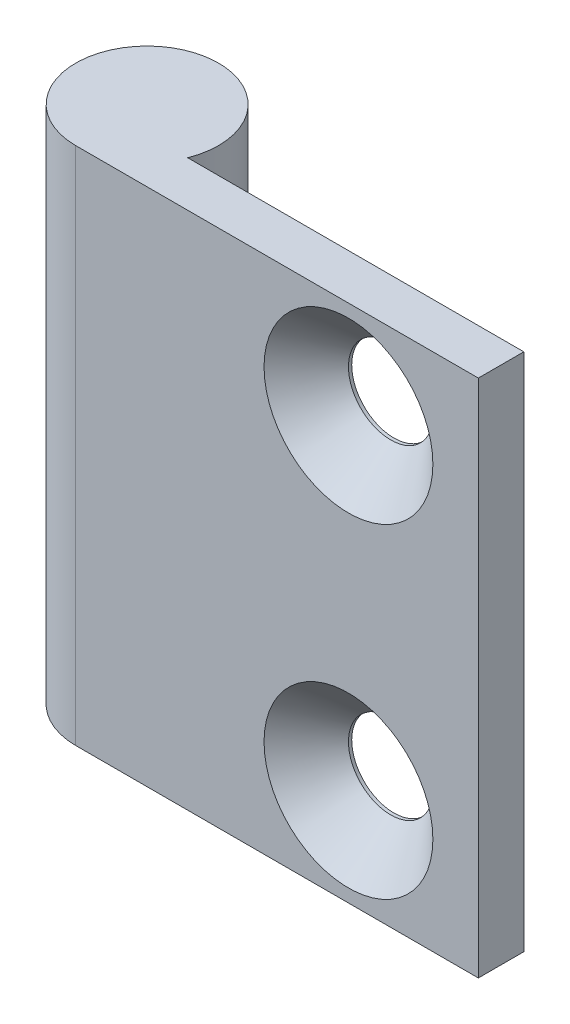
ISO-10303-21;
HEADER;
FILE_DESCRIPTION(('STEP AP214'),'2;1');
FILE_NAME('part.step','',(''),(''),'','','');
FILE_SCHEMA(('AUTOMOTIVE_DESIGN { 1 0 10303 214 1 1 1 1 }'));
ENDSEC;
DATA;
#1=APPLICATION_CONTEXT('core data for automotive mechanical design processes');
#2=APPLICATION_PROTOCOL_DEFINITION('international standard','automotive_design',2000,#1);
#3=PRODUCT_CONTEXT('',#1,'mechanical');
#4=PRODUCT('Part','Part','',(#3));
#5=PRODUCT_RELATED_PRODUCT_CATEGORY('part','',(#4));
#6=PRODUCT_DEFINITION_FORMATION('','',#4);
#7=PRODUCT_DEFINITION_CONTEXT('part definition',#1,'design');
#8=PRODUCT_DEFINITION('design','',#6,#7);
#9=PRODUCT_DEFINITION_SHAPE('','',#8);
#10=(LENGTH_UNIT() NAMED_UNIT(*) SI_UNIT(.MILLI.,.METRE.));
#11=(NAMED_UNIT(*) PLANE_ANGLE_UNIT() SI_UNIT($,.RADIAN.));
#12=(NAMED_UNIT(*) SI_UNIT($,.STERADIAN.) SOLID_ANGLE_UNIT());
#13=UNCERTAINTY_MEASURE_WITH_UNIT(LENGTH_MEASURE(1.E-05),#10,'distance_accuracy_value','');
#14=(GEOMETRIC_REPRESENTATION_CONTEXT(3) GLOBAL_UNCERTAINTY_ASSIGNED_CONTEXT((#13)) GLOBAL_UNIT_ASSIGNED_CONTEXT((#10,
#11,#12)) REPRESENTATION_CONTEXT('',''));
#15=CARTESIAN_POINT('',(0.,0.,0.));
#16=DIRECTION('',(0.,0.,1.));
#17=DIRECTION('',(1.,0.,0.));
#18=AXIS2_PLACEMENT_3D('',#15,#16,#17);
#19=CARTESIAN_POINT('',(31.,-1.7,2.));
#20=DIRECTION('',(1.,0.,0.));
#21=DIRECTION('',(0.,0.,-1.));
#22=AXIS2_PLACEMENT_3D('',#19,#20,#21);
#23=PLANE('',#22);
#24=DIRECTION('',(0.,0.,1.));
#25=VECTOR('',#24,1.);
#26=CARTESIAN_POINT('',(31.,-41.7,2.));
#27=LINE('',#26,#25);
#28=CARTESIAN_POINT('',(31.,-41.7,2.));
#29=VERTEX_POINT('',#28);
#30=CARTESIAN_POINT('',(31.,-41.7,5.5));
#31=VERTEX_POINT('',#30);
#32=EDGE_CURVE('E100',#29,#31,#27,.T.);
#33=ORIENTED_EDGE('',*,*,#32,.F.);
#34=DIRECTION('',(0.,-1.,0.));
#35=VECTOR('',#34,1.);
#36=CARTESIAN_POINT('',(31.,-1.7,2.));
#37=LINE('',#36,#35);
#38=CARTESIAN_POINT('',(31.,-1.7,2.));
#39=VERTEX_POINT('',#38);
#40=EDGE_CURVE('E11',#39,#29,#37,.T.);
#41=ORIENTED_EDGE('',*,*,#40,.F.);
#42=DIRECTION('',(0.,0.,1.));
#43=VECTOR('',#42,1.);
#44=CARTESIAN_POINT('',(31.,-1.7,2.));
#45=LINE('',#44,#43);
#46=CARTESIAN_POINT('',(31.,-1.7,5.5));
#47=VERTEX_POINT('',#46);
#48=EDGE_CURVE('E93',#39,#47,#45,.T.);
#49=ORIENTED_EDGE('',*,*,#48,.T.);
#50=DIRECTION('',(0.,-1.,0.));
#51=VECTOR('',#50,1.);
#52=CARTESIAN_POINT('',(31.,-1.7,5.5));
#53=LINE('',#52,#51);
#54=EDGE_CURVE('E76',#47,#31,#53,.T.);
#55=ORIENTED_EDGE('',*,*,#54,.T.);
#56=EDGE_LOOP('',(#33,#41,#49,#55));
#57=FACE_BOUND('',#56,.T.);
#58=ADVANCED_FACE('F33',(#57),#23,.T.);
#59=CARTESIAN_POINT('',(5.1234753829798,-1.7,2.));
#60=DIRECTION('',(0.,0.,-1.));
#61=DIRECTION('',(-1.,0.,0.));
#62=AXIS2_PLACEMENT_3D('',#59,#60,#61);
#63=PLANE('',#62);
#64=CARTESIAN_POINT('',(21.,-34.2,2.));
#65=DIRECTION('',(0.,0.,-1.));
#66=DIRECTION('',(-1.,0.,0.));
#67=AXIS2_PLACEMENT_3D('',#64,#65,#66);
#68=CIRCLE('',#67,3.25000000003527);
#69=CARTESIAN_POINT('',(17.7499999999647,-34.2,2.));
#70=VERTEX_POINT('',#69);
#71=EDGE_CURVE('E36',#70,#70,#68,.T.);
#72=ORIENTED_EDGE('',*,*,#71,.F.);
#73=EDGE_LOOP('',(#72));
#74=FACE_BOUND('',#73,.T.);
#75=CARTESIAN_POINT('',(21.,-9.2,2.));
#76=DIRECTION('',(0.,0.,-1.));
#77=DIRECTION('',(-1.,0.,0.));
#78=AXIS2_PLACEMENT_3D('',#75,#76,#77);
#79=CIRCLE('',#78,3.25000000003527);
#80=CARTESIAN_POINT('',(17.7499999999647,-9.2,2.));
#81=VERTEX_POINT('',#80);
#82=EDGE_CURVE('E104',#81,#81,#79,.T.);
#83=ORIENTED_EDGE('',*,*,#82,.F.);
#84=EDGE_LOOP('',(#83));
#85=FACE_BOUND('',#84,.T.);
#86=DIRECTION('',(1.,0.,0.));
#87=VECTOR('',#86,1.);
#88=CARTESIAN_POINT('',(5.1234753829798,-41.7,2.));
#89=LINE('',#88,#87);
#90=CARTESIAN_POINT('',(5.1234753829798,-41.7,2.));
#91=VERTEX_POINT('',#90);
#92=EDGE_CURVE('E95',#91,#29,#89,.T.);
#93=ORIENTED_EDGE('',*,*,#92,.F.);
#94=DIRECTION('',(0.,-1.,0.));
#95=VECTOR('',#94,1.);
#96=CARTESIAN_POINT('',(5.1234753829798,-1.7,2.));
#97=LINE('',#96,#95);
#98=CARTESIAN_POINT('',(5.1234753829798,-1.7,2.));
#99=VERTEX_POINT('',#98);
#100=EDGE_CURVE('E42',#99,#91,#97,.T.);
#101=ORIENTED_EDGE('',*,*,#100,.F.);
#102=DIRECTION('',(1.,0.,0.));
#103=VECTOR('',#102,1.);
#104=CARTESIAN_POINT('',(5.1234753829798,-1.7,2.));
#105=LINE('',#104,#103);
#106=EDGE_CURVE('E90',#99,#39,#105,.T.);
#107=ORIENTED_EDGE('',*,*,#106,.T.);
#108=ORIENTED_EDGE('',*,*,#40,.T.);
#109=EDGE_LOOP('',(#93,#101,#107,#108));
#110=FACE_BOUND('',#109,.T.);
#111=ADVANCED_FACE('F149',(#74,#85,#110),#63,.T.);
#112=CARTESIAN_POINT('',(0.,-1.7,0.));
#113=DIRECTION('',(0.,-1.,0.));
#114=DIRECTION('',(0.,0.,-1.));
#115=AXIS2_PLACEMENT_3D('',#112,#113,#114);
#116=CYLINDRICAL_SURFACE('',#115,5.5);
#117=CARTESIAN_POINT('',(0.,-41.7,0.));
#118=DIRECTION('',(0.,-1.,0.));
#119=DIRECTION('',(0.,0.,-1.));
#120=AXIS2_PLACEMENT_3D('',#117,#118,#119);
#121=CIRCLE('',#120,5.5);
#122=CARTESIAN_POINT('',(0.,-41.7,5.5));
#123=VERTEX_POINT('',#122);
#124=EDGE_CURVE('E84',#123,#91,#121,.T.);
#125=ORIENTED_EDGE('',*,*,#124,.F.);
#126=DIRECTION('',(0.,-1.,0.));
#127=VECTOR('',#126,1.);
#128=CARTESIAN_POINT('',(0.,-1.7,5.5));
#129=LINE('',#128,#127);
#130=CARTESIAN_POINT('',(0.,-1.7,5.5));
#131=VERTEX_POINT('',#130);
#132=EDGE_CURVE('E79',#131,#123,#129,.T.);
#133=ORIENTED_EDGE('',*,*,#132,.F.);
#134=CARTESIAN_POINT('',(0.,-1.7,0.));
#135=DIRECTION('',(0.,-1.,0.));
#136=DIRECTION('',(0.,0.,-1.));
#137=AXIS2_PLACEMENT_3D('',#134,#135,#136);
#138=CIRCLE('',#137,5.5);
#139=EDGE_CURVE('E82',#131,#99,#138,.T.);
#140=ORIENTED_EDGE('',*,*,#139,.T.);
#141=ORIENTED_EDGE('',*,*,#100,.T.);
#142=EDGE_LOOP('',(#125,#133,#140,#141));
#143=FACE_BOUND('',#142,.T.);
#144=ADVANCED_FACE('F81',(#143),#116,.T.);
#145=CARTESIAN_POINT('',(31.,-1.7,5.5));
#146=DIRECTION('',(0.,0.,1.));
#147=DIRECTION('',(1.,0.,0.));
#148=AXIS2_PLACEMENT_3D('',#145,#146,#147);
#149=PLANE('',#148);
#150=CARTESIAN_POINT('',(21.,-34.2,5.5));
#151=DIRECTION('',(0.,0.,1.));
#152=DIRECTION('',(1.,0.,0.));
#153=AXIS2_PLACEMENT_3D('',#150,#151,#152);
#154=CIRCLE('',#153,6.49999999995844);
#155=CARTESIAN_POINT('',(27.4999999999584,-34.2,5.5));
#156=VERTEX_POINT('',#155);
#157=EDGE_CURVE('E124',#156,#156,#154,.T.);
#158=ORIENTED_EDGE('',*,*,#157,.F.);
#159=EDGE_LOOP('',(#158));
#160=FACE_BOUND('',#159,.T.);
#161=CARTESIAN_POINT('',(21.,-9.2,5.5));
#162=DIRECTION('',(0.,0.,1.));
#163=DIRECTION('',(1.,0.,0.));
#164=AXIS2_PLACEMENT_3D('',#161,#162,#163);
#165=CIRCLE('',#164,6.49999999995844);
#166=CARTESIAN_POINT('',(27.4999999999584,-9.2,5.5));
#167=VERTEX_POINT('',#166);
#168=EDGE_CURVE('E115',#167,#167,#165,.T.);
#169=ORIENTED_EDGE('',*,*,#168,.F.);
#170=EDGE_LOOP('',(#169));
#171=FACE_BOUND('',#170,.T.);
#172=DIRECTION('',(-1.,0.,0.));
#173=VECTOR('',#172,1.);
#174=CARTESIAN_POINT('',(31.,-41.7,5.5));
#175=LINE('',#174,#173);
#176=EDGE_CURVE('E103',#31,#123,#175,.T.);
#177=ORIENTED_EDGE('',*,*,#176,.F.);
#178=ORIENTED_EDGE('',*,*,#54,.F.);
#179=DIRECTION('',(-1.,0.,0.));
#180=VECTOR('',#179,1.);
#181=CARTESIAN_POINT('',(31.,-1.7,5.5));
#182=LINE('',#181,#180);
#183=EDGE_CURVE('E89',#47,#131,#182,.T.);
#184=ORIENTED_EDGE('',*,*,#183,.T.);
#185=ORIENTED_EDGE('',*,*,#132,.T.);
#186=EDGE_LOOP('',(#177,#178,#184,#185));
#187=FACE_BOUND('',#186,.T.);
#188=ADVANCED_FACE('F92',(#160,#171,#187),#149,.T.);
#189=CARTESIAN_POINT('',(0.,-1.7,0.));
#190=DIRECTION('',(0.,-1.,0.));
#191=DIRECTION('',(0.,0.,-1.));
#192=AXIS2_PLACEMENT_3D('',#189,#190,#191);
#193=PLANE('',#192);
#194=ORIENTED_EDGE('',*,*,#48,.F.);
#195=ORIENTED_EDGE('',*,*,#106,.F.);
#196=ORIENTED_EDGE('',*,*,#139,.F.);
#197=ORIENTED_EDGE('',*,*,#183,.F.);
#198=EDGE_LOOP('',(#194,#195,#196,#197));
#199=FACE_BOUND('',#198,.T.);
#200=ADVANCED_FACE('F88',(#199),#193,.F.);
#201=CARTESIAN_POINT('',(0.,-41.7,0.));
#202=DIRECTION('',(0.,-1.,0.));
#203=DIRECTION('',(0.,0.,-1.));
#204=AXIS2_PLACEMENT_3D('',#201,#202,#203);
#205=PLANE('',#204);
#206=ORIENTED_EDGE('',*,*,#32,.T.);
#207=ORIENTED_EDGE('',*,*,#176,.T.);
#208=ORIENTED_EDGE('',*,*,#124,.T.);
#209=ORIENTED_EDGE('',*,*,#92,.T.);
#210=EDGE_LOOP('',(#206,#207,#208,#209));
#211=FACE_BOUND('',#210,.T.);
#212=ADVANCED_FACE('F146',(#211),#205,.T.);
#213=CARTESIAN_POINT('',(21.,-9.2,5.5));
#214=DIRECTION('',(0.,0.,1.));
#215=DIRECTION('',(1.,0.,0.));
#216=AXIS2_PLACEMENT_3D('',#213,#214,#215);
#217=CYLINDRICAL_SURFACE('',#216,3.25000000003527);
#218=ORIENTED_EDGE('',*,*,#82,.T.);
#219=EDGE_LOOP('',(#218));
#220=FACE_BOUND('',#219,.T.);
#221=CARTESIAN_POINT('',(21.,-9.2,2.25000000007685));
#222=DIRECTION('',(0.,0.,1.));
#223=DIRECTION('',(1.,0.,0.));
#224=AXIS2_PLACEMENT_3D('',#221,#222,#223);
#225=CIRCLE('',#224,3.25000000003528);
#226=CARTESIAN_POINT('',(24.2500000000353,-9.2,2.25000000007685));
#227=VERTEX_POINT('',#226);
#228=EDGE_CURVE('E111',#227,#227,#225,.T.);
#229=ORIENTED_EDGE('',*,*,#228,.T.);
#230=EDGE_LOOP('',(#229));
#231=FACE_BOUND('',#230,.T.);
#232=ADVANCED_FACE('F137',(#220,#231),#217,.F.);
#233=CARTESIAN_POINT('',(21.,-9.2,5.5));
#234=DIRECTION('',(0.,0.,1.));
#235=DIRECTION('',(1.,0.,0.));
#236=AXIS2_PLACEMENT_3D('',#233,#234,#235);
#237=CONICAL_SURFACE('',#236,6.49999999995844,0.78539816339745);
#238=ORIENTED_EDGE('',*,*,#228,.F.);
#239=EDGE_LOOP('',(#238));
#240=FACE_BOUND('',#239,.T.);
#241=ORIENTED_EDGE('',*,*,#168,.T.);
#242=EDGE_LOOP('',(#241));
#243=FACE_BOUND('',#242,.T.);
#244=ADVANCED_FACE('F134',(#240,#243),#237,.F.);
#245=CARTESIAN_POINT('',(21.,-34.2,5.5));
#246=DIRECTION('',(0.,0.,1.));
#247=DIRECTION('',(1.,0.,0.));
#248=AXIS2_PLACEMENT_3D('',#245,#246,#247);
#249=CYLINDRICAL_SURFACE('',#248,3.25000000003527);
#250=ORIENTED_EDGE('',*,*,#71,.T.);
#251=EDGE_LOOP('',(#250));
#252=FACE_BOUND('',#251,.T.);
#253=CARTESIAN_POINT('',(21.,-34.2,2.25000000007685));
#254=DIRECTION('',(0.,0.,1.));
#255=DIRECTION('',(1.,0.,0.));
#256=AXIS2_PLACEMENT_3D('',#253,#254,#255);
#257=CIRCLE('',#256,3.25000000003528);
#258=CARTESIAN_POINT('',(24.2500000000353,-34.2,2.25000000007685));
#259=VERTEX_POINT('',#258);
#260=EDGE_CURVE('E121',#259,#259,#257,.T.);
#261=ORIENTED_EDGE('',*,*,#260,.T.);
#262=EDGE_LOOP('',(#261));
#263=FACE_BOUND('',#262,.T.);
#264=ADVANCED_FACE('F136',(#252,#263),#249,.F.);
#265=CARTESIAN_POINT('',(21.,-34.2,5.5));
#266=DIRECTION('',(0.,0.,1.));
#267=DIRECTION('',(1.,0.,0.));
#268=AXIS2_PLACEMENT_3D('',#265,#266,#267);
#269=CONICAL_SURFACE('',#268,6.49999999995844,0.78539816339745);
#270=ORIENTED_EDGE('',*,*,#260,.F.);
#271=EDGE_LOOP('',(#270));
#272=FACE_BOUND('',#271,.T.);
#273=ORIENTED_EDGE('',*,*,#157,.T.);
#274=EDGE_LOOP('',(#273));
#275=FACE_BOUND('',#274,.T.);
#276=ADVANCED_FACE('F128',(#272,#275),#269,.F.);
#277=CLOSED_SHELL('',(#58,#111,#144,#188,#200,#212,#232,#244,#264,#276));
#278=MANIFOLD_SOLID_BREP('B2',#277);
#279=ADVANCED_BREP_SHAPE_REPRESENTATION('',(#18,#278),#14);
#280=SHAPE_DEFINITION_REPRESENTATION(#9,#279);
ENDSEC;
END-ISO-10303-21;
